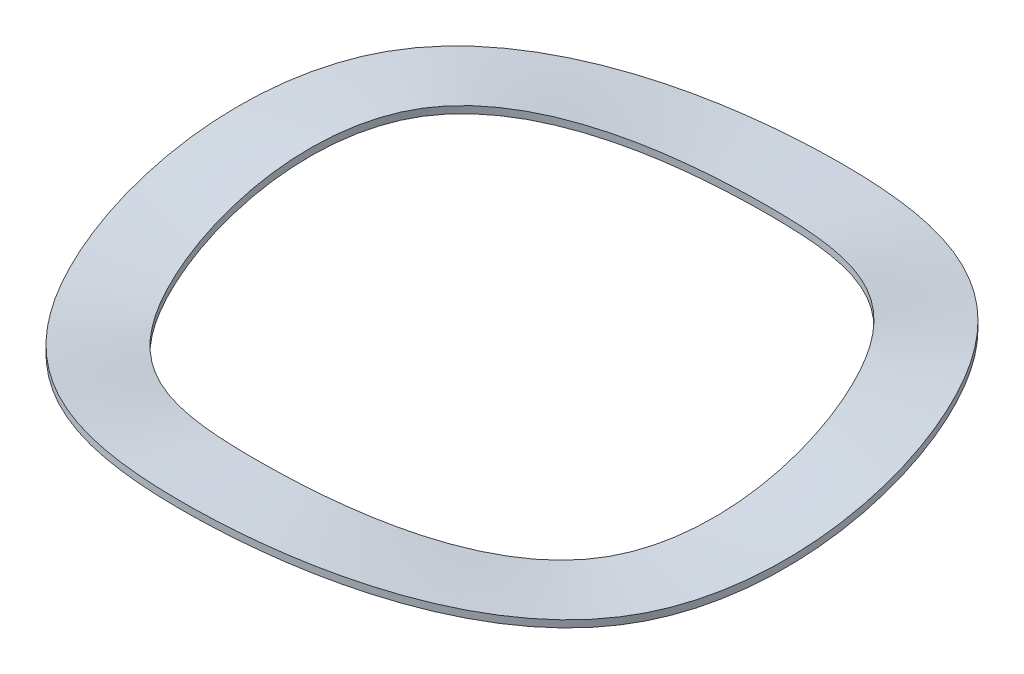
ISO-10303-21;
HEADER;
FILE_DESCRIPTION(('STEP AP214'),'2;1');
FILE_NAME('part.step','',(''),(''),'','','');
FILE_SCHEMA(('AUTOMOTIVE_DESIGN { 1 0 10303 214 1 1 1 1 }'));
ENDSEC;
DATA;
#1=APPLICATION_CONTEXT('core data for automotive mechanical design processes');
#2=APPLICATION_PROTOCOL_DEFINITION('international standard','automotive_design',2000,#1);
#3=PRODUCT_CONTEXT('',#1,'mechanical');
#4=PRODUCT('Part','Part','',(#3));
#5=PRODUCT_RELATED_PRODUCT_CATEGORY('part','',(#4));
#6=PRODUCT_DEFINITION_FORMATION('','',#4);
#7=PRODUCT_DEFINITION_CONTEXT('part definition',#1,'design');
#8=PRODUCT_DEFINITION('design','',#6,#7);
#9=PRODUCT_DEFINITION_SHAPE('','',#8);
#10=(LENGTH_UNIT() NAMED_UNIT(*) SI_UNIT(.MILLI.,.METRE.));
#11=(NAMED_UNIT(*) PLANE_ANGLE_UNIT() SI_UNIT($,.RADIAN.));
#12=(NAMED_UNIT(*) SI_UNIT($,.STERADIAN.) SOLID_ANGLE_UNIT());
#13=UNCERTAINTY_MEASURE_WITH_UNIT(LENGTH_MEASURE(1.E-05),#10,'distance_accuracy_value','');
#14=(GEOMETRIC_REPRESENTATION_CONTEXT(3) GLOBAL_UNCERTAINTY_ASSIGNED_CONTEXT((#13)) GLOBAL_UNIT_ASSIGNED_CONTEXT((#10,
#11,#12)) REPRESENTATION_CONTEXT('',''));
#15=CARTESIAN_POINT('',(0.,0.,0.));
#16=DIRECTION('',(0.,0.,1.));
#17=DIRECTION('',(1.,0.,0.));
#18=AXIS2_PLACEMENT_3D('',#15,#16,#17);
#19=CARTESIAN_POINT('',(0.,0.,-10.6553000000001));
#20=CARTESIAN_POINT('',(3.69110419397778,0.,-10.6553000000001));
#21=CARTESIAN_POINT('',(11.0733125819333,3.12420000000001,-6.39318000000004));
#22=CARTESIAN_POINT('',(11.0733125819333,-1.56210000000018,6.39318000000005));
#23=CARTESIAN_POINT('',(0.,3.12419999999999,12.78636));
#24=CARTESIAN_POINT('',(-11.0733125819334,-1.5621,6.39318000000002));
#25=CARTESIAN_POINT('',(-11.0733125819333,1.56209999999982,-2.13106000000005));
#26=CARTESIAN_POINT('',(-7.38220838795549,1.56210000000018,-8.52424000000008));
#27=CARTESIAN_POINT('',(-3.69110419397775,-1.80411241501588E-13,-10.6553000000001));
#28=CARTESIAN_POINT('',(0.,0.,-10.6553000000001));
#29=CARTESIAN_POINT('',(0.,0.,-11.6755333333334));
#30=CARTESIAN_POINT('',(4.04452338775952,-1.80411241501588E-13,-11.6755333333334));
#31=CARTESIAN_POINT('',(12.1335701632785,3.12420000000001,-7.00532000000005));
#32=CARTESIAN_POINT('',(12.1335701632785,-1.56210000000018,7.00532000000007));
#33=CARTESIAN_POINT('',(0.,3.12420000000017,14.0106400000001));
#34=CARTESIAN_POINT('',(-12.1335701632786,-1.56210000000018,7.00532000000003));
#35=CARTESIAN_POINT('',(-12.1335701632785,1.5621,-2.33510666666673));
#36=CARTESIAN_POINT('',(-8.08904677551899,1.56210000000018,-9.34042666666675));
#37=CARTESIAN_POINT('',(-4.04452338775949,1.80411241501588E-13,-11.6755333333334));
#38=CARTESIAN_POINT('',(0.,0.,-11.6755333333334));
#39=CARTESIAN_POINT('',(0.,0.,-12.6957666666667));
#40=CARTESIAN_POINT('',(4.39794258154128,0.,-12.6957666666667));
#41=CARTESIAN_POINT('',(13.1938277446238,3.12420000000001,-7.61746000000005));
#42=CARTESIAN_POINT('',(13.1938277446237,-1.56210000000018,7.61746000000007));
#43=CARTESIAN_POINT('',(0.,3.12419999999999,15.2349200000001));
#44=CARTESIAN_POINT('',(-13.1938277446238,-1.5621,7.61746000000003));
#45=CARTESIAN_POINT('',(-13.1938277446237,1.5621,-2.53915333333339));
#46=CARTESIAN_POINT('',(-8.79588516308247,1.56210000000018,-10.1566133333334));
#47=CARTESIAN_POINT('',(-4.39794258154123,1.80411241501588E-13,-12.6957666666668));
#48=CARTESIAN_POINT('',(0.,0.,-12.6957666666667));
#49=CARTESIAN_POINT('',(0.,0.,-13.7160000000001));
#50=CARTESIAN_POINT('',(4.75136177532301,0.,-13.7160000000001));
#51=CARTESIAN_POINT('',(14.254085325969,3.12419999999999,-8.22960000000004));
#52=CARTESIAN_POINT('',(14.2540853259689,-1.5621,8.22960000000007));
#53=CARTESIAN_POINT('',(0.,3.12419999999981,16.4592000000001));
#54=CARTESIAN_POINT('',(-14.254085325969,-1.56210000000018,8.22960000000002));
#55=CARTESIAN_POINT('',(-14.254085325969,1.5621,-2.74320000000006));
#56=CARTESIAN_POINT('',(-9.50272355064594,1.56210000000018,-10.9728000000001));
#57=CARTESIAN_POINT('',(-4.75136177532297,0.,-13.7160000000001));
#58=CARTESIAN_POINT('',(0.,0.,-13.7160000000001));
#59=B_SPLINE_SURFACE_WITH_KNOTS('',3,3,((#19,#20,#21,#22,#23,#24,#25,#26,#27,#28),(#29,#30,#31,
#32,#33,#34,#35,#36,#37,#38),(#39,#40,#41,#42,#43,#44,#45,#46,#47,#48),(#49,#50,#51,#52,#53,#54,
#55,#56,#57,#58)),.UNSPECIFIED.,.F.,.T.,.F.,(4,4),(4,1,1,1,1,2,4),(0.,1.),(0.,0.166666666666667,
0.333333333333334,0.5,0.666666666666666,0.833333333333333,1.),.UNSPECIFIED.);
#60=CARTESIAN_POINT('',(0.,0.,-13.7160000000001));
#61=CARTESIAN_POINT('',(4.75136177532301,0.,-13.7160000000001));
#62=CARTESIAN_POINT('',(14.254085325969,3.12419999999999,-8.22960000000004));
#63=CARTESIAN_POINT('',(14.2540853259689,-1.5621,8.22960000000007));
#64=CARTESIAN_POINT('',(0.,3.12419999999981,16.4592000000001));
#65=CARTESIAN_POINT('',(-14.254085325969,-1.56210000000018,8.22960000000002));
#66=CARTESIAN_POINT('',(-14.254085325969,1.5621,-2.74320000000006));
#67=CARTESIAN_POINT('',(-9.50272355064594,1.56210000000018,-10.9728000000001));
#68=CARTESIAN_POINT('',(-4.75136177532297,0.,-13.7160000000001));
#69=CARTESIAN_POINT('',(0.,0.,-13.7160000000001));
#70=B_SPLINE_CURVE_WITH_KNOTS('',3,(#60,#61,#62,#63,#64,#65,#66,#67,#68,#69),.UNSPECIFIED.,.T.,
.F.,(4,1,1,1,1,2,4),(0.,0.166666666666667,0.333333333333334,0.5,0.666666666666666,
0.833333333333333,1.),.UNSPECIFIED.);
#71=CARTESIAN_POINT('',(0.,0.,-13.7160000000001));
#72=VERTEX_POINT('',#71);
#73=EDGE_CURVE('E21',#72,#72,#70,.F.);
#74=CARTESIAN_POINT('',(0.,0.,-10.6553000000001));
#75=CARTESIAN_POINT('',(3.69110419397778,0.,-10.6553000000001));
#76=CARTESIAN_POINT('',(11.0733125819333,3.12420000000001,-6.39318000000004));
#77=CARTESIAN_POINT('',(11.0733125819333,-1.56210000000018,6.39318000000005));
#78=CARTESIAN_POINT('',(0.,3.12419999999999,12.78636));
#79=CARTESIAN_POINT('',(-11.0733125819334,-1.5621,6.39318000000002));
#80=CARTESIAN_POINT('',(-11.0733125819333,1.56209999999982,-2.13106000000005));
#81=CARTESIAN_POINT('',(-7.38220838795549,1.56210000000018,-8.52424000000008));
#82=CARTESIAN_POINT('',(-3.69110419397775,-1.80411241501588E-13,-10.6553000000001));
#83=CARTESIAN_POINT('',(0.,0.,-10.6553000000001));
#84=B_SPLINE_CURVE_WITH_KNOTS('',3,(#74,#75,#76,#77,#78,#79,#80,#81,#82,#83),.UNSPECIFIED.,.T.,
.F.,(4,1,1,1,1,2,4),(0.,0.166666666666667,0.333333333333334,0.5,0.666666666666666,
0.833333333333333,1.),.UNSPECIFIED.);
#85=CARTESIAN_POINT('',(0.,0.,-10.6553000000001));
#86=VERTEX_POINT('',#85);
#87=EDGE_CURVE('E32',#86,#86,#84,.T.);
#88=ORIENTED_EDGE('',*,*,#73,.F.);
#89=EDGE_LOOP('',(#88));
#90=FACE_BOUND('',#89,.T.);
#91=ORIENTED_EDGE('',*,*,#87,.F.);
#92=EDGE_LOOP('',(#91));
#93=FACE_BOUND('',#92,.T.);
#94=ADVANCED_FACE('F15',(#90,#93),#59,.T.);
#95=CARTESIAN_POINT('',(0.,0.,-13.7160000000001));
#96=CARTESIAN_POINT('',(4.75136177532301,0.,-13.7160000000001));
#97=CARTESIAN_POINT('',(14.254085325969,3.12419999999999,-8.22960000000004));
#98=CARTESIAN_POINT('',(14.2540853259689,-1.5621,8.22960000000007));
#99=CARTESIAN_POINT('',(0.,3.12419999999981,16.4592000000001));
#100=CARTESIAN_POINT('',(-14.254085325969,-1.56210000000018,8.22960000000002));
#101=CARTESIAN_POINT('',(-14.254085325969,1.5621,-2.74320000000006));
#102=CARTESIAN_POINT('',(-9.50272355064594,1.56210000000018,-10.9728000000001));
#103=CARTESIAN_POINT('',(-4.75136177532297,0.,-13.7160000000001));
#104=CARTESIAN_POINT('',(0.,0.,-13.7160000000001));
#105=CARTESIAN_POINT('',(0.,0.0973666666666539,-13.7160000000001));
#106=CARTESIAN_POINT('',(4.75136177532301,0.0973666666666539,-13.7160000000001));
#107=CARTESIAN_POINT('',(14.254085325969,3.22156666666666,-8.22960000000008));
#108=CARTESIAN_POINT('',(14.2540853259689,-1.46473333333334,8.22960000000007));
#109=CARTESIAN_POINT('',(0.,3.22156666666648,16.4592000000001));
#110=CARTESIAN_POINT('',(-14.254085325969,-1.46473333333351,8.22960000000002));
#111=CARTESIAN_POINT('',(-14.2540853259689,1.65946666666666,-2.74320000000006));
#112=CARTESIAN_POINT('',(-9.50272355064593,1.65946666666684,-10.9728000000001));
#113=CARTESIAN_POINT('',(-4.75136177532295,0.0973666666666539,-13.7160000000001));
#114=CARTESIAN_POINT('',(0.,0.0973666666666539,-13.7160000000001));
#115=CARTESIAN_POINT('',(0.,0.194733333333322,-13.7160000000001));
#116=CARTESIAN_POINT('',(4.75136177532302,0.194733333333322,-13.7160000000001));
#117=CARTESIAN_POINT('',(14.254085325969,3.31893333333333,-8.22960000000004));
#118=CARTESIAN_POINT('',(14.2540853259689,-1.36736666666668,8.22960000000004));
#119=CARTESIAN_POINT('',(0.,3.31893333333315,16.4592000000001));
#120=CARTESIAN_POINT('',(-14.2540853259691,-1.36736666666684,8.2296));
#121=CARTESIAN_POINT('',(-14.254085325969,1.75683333333333,-2.74320000000006));
#122=CARTESIAN_POINT('',(-9.50272355064593,1.75683333333351,-10.9728000000001));
#123=CARTESIAN_POINT('',(-4.75136177532295,0.194733333333322,-13.7160000000001));
#124=CARTESIAN_POINT('',(0.,0.194733333333322,-13.7160000000001));
#125=CARTESIAN_POINT('',(0.,0.29209999999999,-13.7160000000001));
#126=CARTESIAN_POINT('',(4.75136177532301,0.29209999999999,-13.7160000000001));
#127=CARTESIAN_POINT('',(14.254085325969,3.4163,-8.22960000000005));
#128=CARTESIAN_POINT('',(14.2540853259689,-1.27000000000001,8.22960000000004));
#129=CARTESIAN_POINT('',(0.,3.41629999999982,16.4592000000001));
#130=CARTESIAN_POINT('',(-14.2540853259691,-1.27000000000017,8.22960000000001));
#131=CARTESIAN_POINT('',(-14.254085325969,1.8542,-2.74320000000008));
#132=CARTESIAN_POINT('',(-9.50272355064594,1.85420000000018,-10.9728000000001));
#133=CARTESIAN_POINT('',(-4.75136177532296,0.29209999999999,-13.7160000000001));
#134=CARTESIAN_POINT('',(0.,0.29209999999999,-13.7160000000001));
#135=B_SPLINE_SURFACE_WITH_KNOTS('',3,3,((#95,#96,#97,#98,#99,#100,#101,#102,#103,#104),(#105,
#106,#107,#108,#109,#110,#111,#112,#113,#114),(#115,#116,#117,#118,#119,#120,#121,#122,#123,
#124),(#125,#126,#127,#128,#129,#130,#131,#132,#133,#134)),.UNSPECIFIED.,.F.,.T.,.F.,(4,4),(4,1,
1,1,1,2,4),(0.,1.),(0.,0.166666666666667,0.333333333333334,0.5,0.666666666666666,
0.833333333333333,1.),.UNSPECIFIED.);
#136=CARTESIAN_POINT('',(0.,0.29209999999999,-13.7160000000001));
#137=CARTESIAN_POINT('',(4.75136177532301,0.29209999999999,-13.7160000000001));
#138=CARTESIAN_POINT('',(14.254085325969,3.4163,-8.22960000000005));
#139=CARTESIAN_POINT('',(14.2540853259689,-1.27000000000001,8.22960000000004));
#140=CARTESIAN_POINT('',(0.,3.41629999999982,16.4592000000001));
#141=CARTESIAN_POINT('',(-14.2540853259691,-1.27000000000017,8.22960000000001));
#142=CARTESIAN_POINT('',(-14.254085325969,1.8542,-2.74320000000008));
#143=CARTESIAN_POINT('',(-9.50272355064594,1.85420000000018,-10.9728000000001));
#144=CARTESIAN_POINT('',(-4.75136177532296,0.29209999999999,-13.7160000000001));
#145=CARTESIAN_POINT('',(0.,0.29209999999999,-13.7160000000001));
#146=B_SPLINE_CURVE_WITH_KNOTS('',3,(#136,#137,#138,#139,#140,#141,#142,#143,#144,#145),
.UNSPECIFIED.,.T.,.F.,(4,1,1,1,1,2,4),(0.,0.166666666666667,0.333333333333334,0.5,
0.666666666666666,0.833333333333333,1.),.UNSPECIFIED.);
#147=CARTESIAN_POINT('',(0.,0.29209999999999,-13.7160000000001));
#148=VERTEX_POINT('',#147);
#149=EDGE_CURVE('E27',#148,#148,#146,.F.);
#150=ORIENTED_EDGE('',*,*,#149,.F.);
#151=EDGE_LOOP('',(#150));
#152=FACE_BOUND('',#151,.T.);
#153=ORIENTED_EDGE('',*,*,#73,.T.);
#154=EDGE_LOOP('',(#153));
#155=FACE_BOUND('',#154,.T.);
#156=ADVANCED_FACE('F55',(#152,#155),#135,.T.);
#157=CARTESIAN_POINT('',(0.,0.292099999999913,-10.6553000000001));
#158=CARTESIAN_POINT('',(3.69110419397778,0.292100000000003,-10.6553000000001));
#159=CARTESIAN_POINT('',(11.0733125819333,3.4163,-6.39318000000004));
#160=CARTESIAN_POINT('',(11.0733125819332,-1.27000000000019,6.39318000000004));
#161=CARTESIAN_POINT('',(0.,3.4163,12.7863600000001));
#162=CARTESIAN_POINT('',(-11.0733125819334,-1.27000000000001,6.39318000000001));
#163=CARTESIAN_POINT('',(-11.0733125819333,1.85419999999981,-2.13106000000005));
#164=CARTESIAN_POINT('',(-7.38220838795548,1.85420000000018,-8.52424000000008));
#165=CARTESIAN_POINT('',(-3.69110419397776,0.292099999999823,-10.6553000000001));
#166=CARTESIAN_POINT('',(0.,0.292099999999913,-10.6553000000001));
#167=CARTESIAN_POINT('',(0.,0.194733333333245,-10.6553000000001));
#168=CARTESIAN_POINT('',(3.69110419397778,0.194733333333336,-10.6553000000001));
#169=CARTESIAN_POINT('',(11.0733125819333,3.31893333333334,-6.39318000000004));
#170=CARTESIAN_POINT('',(11.0733125819332,-1.36736666666684,6.39318000000004));
#171=CARTESIAN_POINT('',(0.,3.31893333333333,12.7863600000001));
#172=CARTESIAN_POINT('',(-11.0733125819334,-1.36736666666668,6.39318000000002));
#173=CARTESIAN_POINT('',(-11.0733125819333,1.75683333333315,-2.13106000000004));
#174=CARTESIAN_POINT('',(-7.38220838795548,1.75683333333351,-8.52424000000009));
#175=CARTESIAN_POINT('',(-3.69110419397774,0.194733333333155,-10.6553000000001));
#176=CARTESIAN_POINT('',(0.,0.194733333333245,-10.6553000000001));
#177=CARTESIAN_POINT('',(0.,0.0973666666665776,-10.6553000000001));
#178=CARTESIAN_POINT('',(3.69110419397778,0.0973666666666678,-10.6553000000001));
#179=CARTESIAN_POINT('',(11.0733125819333,3.22156666666668,-6.39318000000005));
#180=CARTESIAN_POINT('',(11.0733125819333,-1.46473333333351,6.39318000000005));
#181=CARTESIAN_POINT('',(0.,3.22156666666666,12.7863600000001));
#182=CARTESIAN_POINT('',(-11.0733125819334,-1.46473333333334,6.39318000000002));
#183=CARTESIAN_POINT('',(-11.0733125819333,1.65946666666647,-2.13106000000005));
#184=CARTESIAN_POINT('',(-7.38220838795548,1.65946666666684,-8.52424000000006));
#185=CARTESIAN_POINT('',(-3.69110419397775,0.0973666666664874,-10.6553000000001));
#186=CARTESIAN_POINT('',(0.,0.0973666666665776,-10.6553000000001));
#187=CARTESIAN_POINT('',(0.,0.,-10.6553000000001));
#188=CARTESIAN_POINT('',(3.69110419397778,0.,-10.6553000000001));
#189=CARTESIAN_POINT('',(11.0733125819333,3.12420000000001,-6.39318000000004));
#190=CARTESIAN_POINT('',(11.0733125819333,-1.56210000000018,6.39318000000005));
#191=CARTESIAN_POINT('',(0.,3.12419999999999,12.78636));
#192=CARTESIAN_POINT('',(-11.0733125819334,-1.5621,6.39318000000002));
#193=CARTESIAN_POINT('',(-11.0733125819333,1.56209999999982,-2.13106000000005));
#194=CARTESIAN_POINT('',(-7.38220838795549,1.56210000000018,-8.52424000000008));
#195=CARTESIAN_POINT('',(-3.69110419397775,-1.80411241501588E-13,-10.6553000000001));
#196=CARTESIAN_POINT('',(0.,0.,-10.6553000000001));
#197=B_SPLINE_SURFACE_WITH_KNOTS('',3,3,((#157,#158,#159,#160,#161,#162,#163,#164,#165,#166),
(#167,#168,#169,#170,#171,#172,#173,#174,#175,#176),(#177,#178,#179,#180,#181,#182,#183,#184,
#185,#186),(#187,#188,#189,#190,#191,#192,#193,#194,#195,#196)),.UNSPECIFIED.,.F.,.T.,.F.,(4,4),
(4,1,1,1,1,2,4),(0.,1.),(0.,0.166666666666667,0.333333333333334,0.5,0.666666666666666,
0.833333333333333,1.),.UNSPECIFIED.);
#198=CARTESIAN_POINT('',(0.,0.292099999999913,-10.6553000000001));
#199=CARTESIAN_POINT('',(3.69110419397778,0.292100000000003,-10.6553000000001));
#200=CARTESIAN_POINT('',(11.0733125819333,3.4163,-6.39318000000004));
#201=CARTESIAN_POINT('',(11.0733125819332,-1.27000000000019,6.39318000000004));
#202=CARTESIAN_POINT('',(0.,3.4163,12.7863600000001));
#203=CARTESIAN_POINT('',(-11.0733125819334,-1.27000000000001,6.39318000000002));
#204=CARTESIAN_POINT('',(-11.0733125819333,1.85419999999981,-2.13106000000005));
#205=CARTESIAN_POINT('',(-7.38220838795548,1.85420000000018,-8.52424000000008));
#206=CARTESIAN_POINT('',(-3.69110419397776,0.292099999999823,-10.6553000000001));
#207=CARTESIAN_POINT('',(0.,0.292099999999913,-10.6553000000001));
#208=B_SPLINE_CURVE_WITH_KNOTS('',3,(#198,#199,#200,#201,#202,#203,#204,#205,#206,#207),
.UNSPECIFIED.,.T.,.F.,(4,1,1,1,1,2,4),(0.,0.166666666666667,0.333333333333334,0.5,
0.666666666666666,0.833333333333333,1.),.UNSPECIFIED.);
#209=CARTESIAN_POINT('',(0.,0.292099999999913,-10.6553000000001));
#210=VERTEX_POINT('',#209);
#211=EDGE_CURVE('E10',#210,#210,#208,.T.);
#212=ORIENTED_EDGE('',*,*,#87,.T.);
#213=EDGE_LOOP('',(#212));
#214=FACE_BOUND('',#213,.T.);
#215=ORIENTED_EDGE('',*,*,#211,.F.);
#216=EDGE_LOOP('',(#215));
#217=FACE_BOUND('',#216,.T.);
#218=ADVANCED_FACE('F64',(#214,#217),#197,.T.);
#219=CARTESIAN_POINT('',(0.,0.29209999999999,-13.7160000000001));
#220=CARTESIAN_POINT('',(4.75136177532301,0.29209999999999,-13.7160000000001));
#221=CARTESIAN_POINT('',(14.254085325969,3.4163,-8.22960000000005));
#222=CARTESIAN_POINT('',(14.2540853259689,-1.27000000000001,8.22960000000004));
#223=CARTESIAN_POINT('',(0.,3.41629999999982,16.4592000000001));
#224=CARTESIAN_POINT('',(-14.2540853259691,-1.27000000000017,8.22960000000001));
#225=CARTESIAN_POINT('',(-14.254085325969,1.8542,-2.74320000000008));
#226=CARTESIAN_POINT('',(-9.50272355064594,1.85420000000018,-10.9728000000001));
#227=CARTESIAN_POINT('',(-4.75136177532296,0.29209999999999,-13.7160000000001));
#228=CARTESIAN_POINT('',(0.,0.29209999999999,-13.7160000000001));
#229=CARTESIAN_POINT('',(0.,0.29210000000008,-12.6957666666667));
#230=CARTESIAN_POINT('',(4.39794258154127,0.29209999999999,-12.6957666666667));
#231=CARTESIAN_POINT('',(13.1938277446238,3.41630000000001,-7.61746000000007));
#232=CARTESIAN_POINT('',(13.1938277446236,-1.27000000000017,7.61746000000003));
#233=CARTESIAN_POINT('',(0.,3.4163,15.2349200000001));
#234=CARTESIAN_POINT('',(-13.1938277446238,-1.27000000000001,7.61746000000001));
#235=CARTESIAN_POINT('',(-13.1938277446237,1.8542,-2.5391533333334));
#236=CARTESIAN_POINT('',(-8.79588516308246,1.85420000000018,-10.1566133333334));
#237=CARTESIAN_POINT('',(-4.39794258154122,0.29210000000017,-12.6957666666667));
#238=CARTESIAN_POINT('',(0.,0.29210000000008,-12.6957666666667));
#239=CARTESIAN_POINT('',(0.,0.292099999999997,-11.6755333333334));
#240=CARTESIAN_POINT('',(4.04452338775952,0.292099999999823,-11.6755333333334));
#241=CARTESIAN_POINT('',(12.1335701632785,3.4163,-7.00532000000005));
#242=CARTESIAN_POINT('',(12.1335701632784,-1.27000000000017,7.00532000000002));
#243=CARTESIAN_POINT('',(0.,3.41630000000018,14.0106400000001));
#244=CARTESIAN_POINT('',(-12.1335701632786,-1.27000000000017,7.00532000000001));
#245=CARTESIAN_POINT('',(-12.1335701632785,1.85419999999999,-2.33510666666673));
#246=CARTESIAN_POINT('',(-8.08904677551898,1.85420000000018,-9.34042666666675));
#247=CARTESIAN_POINT('',(-4.04452338775947,0.29210000000017,-11.6755333333334));
#248=CARTESIAN_POINT('',(0.,0.292099999999997,-11.6755333333334));
#249=CARTESIAN_POINT('',(0.,0.292099999999913,-10.6553000000001));
#250=CARTESIAN_POINT('',(3.69110419397778,0.292100000000003,-10.6553000000001));
#251=CARTESIAN_POINT('',(11.0733125819333,3.4163,-6.39318000000004));
#252=CARTESIAN_POINT('',(11.0733125819332,-1.27000000000019,6.39318000000004));
#253=CARTESIAN_POINT('',(0.,3.4163,12.7863600000001));
#254=CARTESIAN_POINT('',(-11.0733125819334,-1.27000000000001,6.39318000000002));
#255=CARTESIAN_POINT('',(-11.0733125819333,1.85419999999981,-2.13106000000005));
#256=CARTESIAN_POINT('',(-7.38220838795548,1.85420000000018,-8.52424000000008));
#257=CARTESIAN_POINT('',(-3.69110419397776,0.292099999999823,-10.6553000000001));
#258=CARTESIAN_POINT('',(0.,0.292099999999913,-10.6553000000001));
#259=B_SPLINE_SURFACE_WITH_KNOTS('',3,3,((#219,#220,#221,#222,#223,#224,#225,#226,#227,#228),
(#229,#230,#231,#232,#233,#234,#235,#236,#237,#238),(#239,#240,#241,#242,#243,#244,#245,#246,
#247,#248),(#249,#250,#251,#252,#253,#254,#255,#256,#257,#258)),.UNSPECIFIED.,.F.,.T.,.F.,(4,4),
(4,1,1,1,1,2,4),(0.,1.),(0.,0.166666666666667,0.333333333333334,0.5,0.666666666666666,
0.833333333333333,1.),.UNSPECIFIED.);
#260=ORIENTED_EDGE('',*,*,#211,.T.);
#261=EDGE_LOOP('',(#260));
#262=FACE_BOUND('',#261,.T.);
#263=ORIENTED_EDGE('',*,*,#149,.T.);
#264=EDGE_LOOP('',(#263));
#265=FACE_BOUND('',#264,.T.);
#266=ADVANCED_FACE('F17',(#262,#265),#259,.T.);
#267=CLOSED_SHELL('',(#94,#156,#218,#266));
#268=MANIFOLD_SOLID_BREP('B1',#267);
#269=ADVANCED_BREP_SHAPE_REPRESENTATION('',(#18,#268),#14);
#270=SHAPE_DEFINITION_REPRESENTATION(#9,#269);
ENDSEC;
END-ISO-10303-21;
